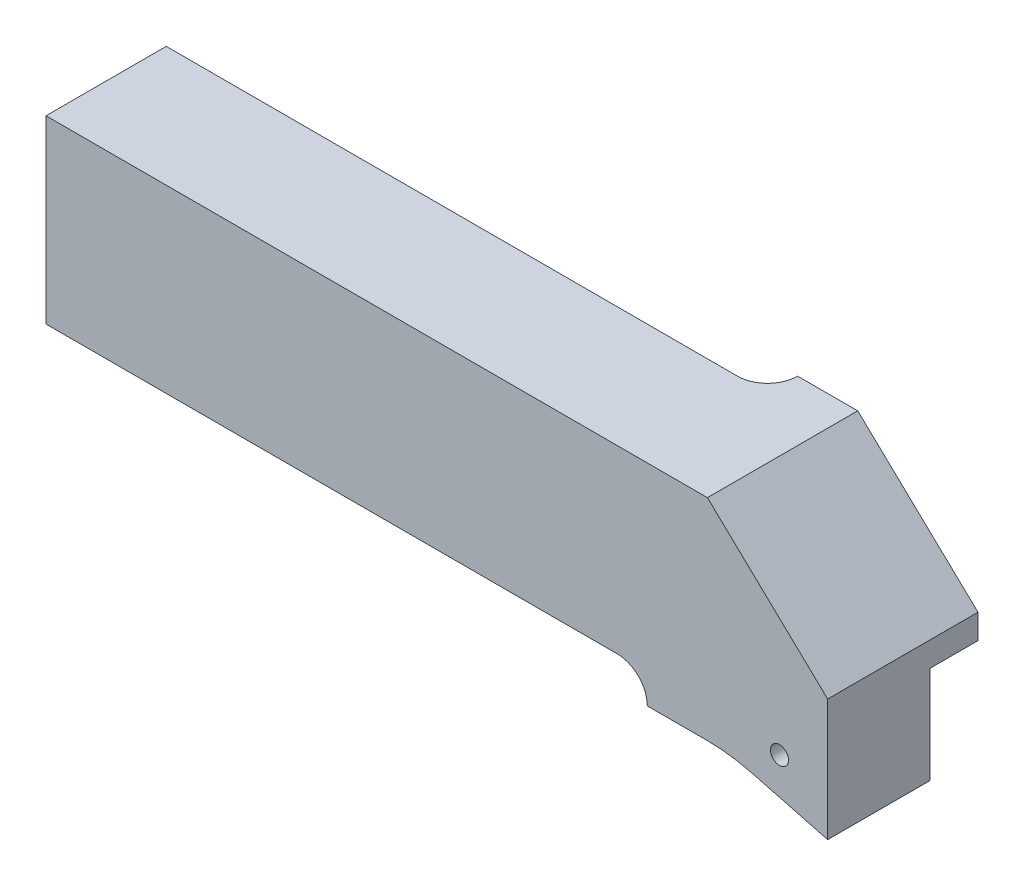
ISO-10303-21;
HEADER;
FILE_DESCRIPTION(('STEP AP214'),'2;1');
FILE_NAME('part.step','',(''),(''),'','','');
FILE_SCHEMA(('AUTOMOTIVE_DESIGN { 1 0 10303 214 1 1 1 1 }'));
ENDSEC;
DATA;
#1=APPLICATION_CONTEXT('core data for automotive mechanical design processes');
#2=APPLICATION_PROTOCOL_DEFINITION('international standard','automotive_design',2000,#1);
#3=PRODUCT_CONTEXT('',#1,'mechanical');
#4=PRODUCT('Part','Part','',(#3));
#5=PRODUCT_RELATED_PRODUCT_CATEGORY('part','',(#4));
#6=PRODUCT_DEFINITION_FORMATION('','',#4);
#7=PRODUCT_DEFINITION_CONTEXT('part definition',#1,'design');
#8=PRODUCT_DEFINITION('design','',#6,#7);
#9=PRODUCT_DEFINITION_SHAPE('','',#8);
#10=(LENGTH_UNIT() NAMED_UNIT(*) SI_UNIT(.MILLI.,.METRE.));
#11=(NAMED_UNIT(*) PLANE_ANGLE_UNIT() SI_UNIT($,.RADIAN.));
#12=(NAMED_UNIT(*) SI_UNIT($,.STERADIAN.) SOLID_ANGLE_UNIT());
#13=UNCERTAINTY_MEASURE_WITH_UNIT(LENGTH_MEASURE(1.E-05),#10,'distance_accuracy_value','');
#14=(GEOMETRIC_REPRESENTATION_CONTEXT(3) GLOBAL_UNCERTAINTY_ASSIGNED_CONTEXT((#13)) GLOBAL_UNIT_ASSIGNED_CONTEXT((#10,
#11,#12)) REPRESENTATION_CONTEXT('',''));
#15=CARTESIAN_POINT('',(0.,0.,0.));
#16=DIRECTION('',(0.,0.,1.));
#17=DIRECTION('',(1.,0.,0.));
#18=AXIS2_PLACEMENT_3D('',#15,#16,#17);
#19=CARTESIAN_POINT('',(77.4303974019249,-20.9751971017439,-5.));
#20=DIRECTION('',(-0.252896150661333,-0.967493429941868,0.));
#21=DIRECTION('',(0.967493429941868,-0.252896150661333,0.));
#22=AXIS2_PLACEMENT_3D('',#19,#20,#21);
#23=PLANE('',#22);
#24=DIRECTION('',(0.,0.,1.));
#25=VECTOR('',#24,1.);
#26=CARTESIAN_POINT('',(77.4303974019249,-20.9751971017439,-5.));
#27=LINE('',#26,#25);
#28=CARTESIAN_POINT('',(77.4303974019249,-20.975197101744,3.));
#29=VERTEX_POINT('',#28);
#30=CARTESIAN_POINT('',(77.4303974019249,-20.9751971017439,20.));
#31=VERTEX_POINT('',#30);
#32=EDGE_CURVE('E151',#29,#31,#27,.T.);
#33=ORIENTED_EDGE('',*,*,#32,.F.);
#34=DIRECTION('',(-0.967493429941868,0.252896150661333,0.));
#35=VECTOR('',#34,1.);
#36=CARTESIAN_POINT('',(77.4303974019249,-20.9751971017439,3.));
#37=LINE('',#36,#35);
#38=CARTESIAN_POINT('',(90.,-24.2608050593989,3.));
#39=VERTEX_POINT('',#38);
#40=EDGE_CURVE('E136',#39,#29,#37,.T.);
#41=ORIENTED_EDGE('',*,*,#40,.F.);
#42=DIRECTION('',(0.,0.,1.));
#43=VECTOR('',#42,1.);
#44=CARTESIAN_POINT('',(90.,-24.2608050593989,-5.));
#45=LINE('',#44,#43);
#46=CARTESIAN_POINT('',(90.,-24.2608050593989,20.));
#47=VERTEX_POINT('',#46);
#48=EDGE_CURVE('E149',#39,#47,#45,.T.);
#49=ORIENTED_EDGE('',*,*,#48,.T.);
#50=DIRECTION('',(0.967493429941868,-0.252896150661333,0.));
#51=VECTOR('',#50,1.);
#52=CARTESIAN_POINT('',(77.4303974019249,-20.9751971017439,20.));
#53=LINE('',#52,#51);
#54=EDGE_CURVE('E245',#31,#47,#53,.T.);
#55=ORIENTED_EDGE('',*,*,#54,.F.);
#56=EDGE_LOOP('',(#33,#41,#49,#55));
#57=FACE_BOUND('',#56,.T.);
#58=ADVANCED_FACE('F36',(#57),#23,.T.);
#59=CARTESIAN_POINT('',(-40.,15.,20.));
#60=DIRECTION('',(0.,-1.,0.));
#61=DIRECTION('',(0.,0.,-1.));
#62=AXIS2_PLACEMENT_3D('',#59,#60,#61);
#63=PLANE('',#62);
#64=DIRECTION('',(-1.,0.,0.));
#65=VECTOR('',#64,1.);
#66=CARTESIAN_POINT('',(60.,15.,-5.));
#67=LINE('',#66,#65);
#68=CARTESIAN_POINT('',(70.,15.,-5.));
#69=VERTEX_POINT('',#68);
#70=CARTESIAN_POINT('',(60.,15.,-5.));
#71=VERTEX_POINT('',#70);
#72=EDGE_CURVE('E170',#69,#71,#67,.T.);
#73=ORIENTED_EDGE('',*,*,#72,.T.);
#74=CARTESIAN_POINT('',(55.,15.,-5.));
#75=DIRECTION('',(0.,-1.,0.));
#76=DIRECTION('',(0.,0.,-1.));
#77=AXIS2_PLACEMENT_3D('',#74,#75,#76);
#78=CIRCLE('',#77,5.);
#79=CARTESIAN_POINT('',(55.,15.,0.));
#80=VERTEX_POINT('',#79);
#81=EDGE_CURVE('E11',#71,#80,#78,.T.);
#82=ORIENTED_EDGE('',*,*,#81,.T.);
#83=DIRECTION('',(-1.,0.,0.));
#84=VECTOR('',#83,1.);
#85=CARTESIAN_POINT('',(-40.,15.,0.));
#86=LINE('',#85,#84);
#87=CARTESIAN_POINT('',(-40.,15.,0.));
#88=VERTEX_POINT('',#87);
#89=EDGE_CURVE('E179',#80,#88,#86,.T.);
#90=ORIENTED_EDGE('',*,*,#89,.T.);
#91=DIRECTION('',(0.,0.,-1.));
#92=VECTOR('',#91,1.);
#93=CARTESIAN_POINT('',(-40.,15.,20.));
#94=LINE('',#93,#92);
#95=CARTESIAN_POINT('',(-40.,15.,20.));
#96=VERTEX_POINT('',#95);
#97=EDGE_CURVE('E185',#96,#88,#94,.T.);
#98=ORIENTED_EDGE('',*,*,#97,.F.);
#99=DIRECTION('',(-1.,0.,0.));
#100=VECTOR('',#99,1.);
#101=CARTESIAN_POINT('',(-40.,15.,20.));
#102=LINE('',#101,#100);
#103=CARTESIAN_POINT('',(70.,15.,20.));
#104=VERTEX_POINT('',#103);
#105=EDGE_CURVE('E171',#104,#96,#102,.T.);
#106=ORIENTED_EDGE('',*,*,#105,.F.);
#107=DIRECTION('',(0.,0.,1.));
#108=VECTOR('',#107,1.);
#109=CARTESIAN_POINT('',(70.,15.,-5.));
#110=LINE('',#109,#108);
#111=EDGE_CURVE('E160',#69,#104,#110,.T.);
#112=ORIENTED_EDGE('',*,*,#111,.F.);
#113=EDGE_LOOP('',(#73,#82,#90,#98,#106,#112));
#114=FACE_BOUND('',#113,.T.);
#115=ADVANCED_FACE('F273',(#114),#63,.F.);
#116=CARTESIAN_POINT('',(-40.,15.,20.));
#117=DIRECTION('',(1.,0.,0.));
#118=DIRECTION('',(0.,0.,-1.));
#119=AXIS2_PLACEMENT_3D('',#116,#117,#118);
#120=PLANE('',#119);
#121=DIRECTION('',(0.,-1.,0.));
#122=VECTOR('',#121,1.);
#123=CARTESIAN_POINT('',(-40.,15.,0.));
#124=LINE('',#123,#122);
#125=CARTESIAN_POINT('',(-40.,-15.,0.));
#126=VERTEX_POINT('',#125);
#127=EDGE_CURVE('E177',#88,#126,#124,.T.);
#128=ORIENTED_EDGE('',*,*,#127,.T.);
#129=DIRECTION('',(0.,0.,-1.));
#130=VECTOR('',#129,1.);
#131=CARTESIAN_POINT('',(-40.,-15.,20.));
#132=LINE('',#131,#130);
#133=CARTESIAN_POINT('',(-40.,-15.,20.));
#134=VERTEX_POINT('',#133);
#135=EDGE_CURVE('E182',#134,#126,#132,.T.);
#136=ORIENTED_EDGE('',*,*,#135,.F.);
#137=DIRECTION('',(0.,-1.,0.));
#138=VECTOR('',#137,1.);
#139=CARTESIAN_POINT('',(-40.,15.,20.));
#140=LINE('',#139,#138);
#141=EDGE_CURVE('E173',#96,#134,#140,.T.);
#142=ORIENTED_EDGE('',*,*,#141,.F.);
#143=ORIENTED_EDGE('',*,*,#97,.T.);
#144=EDGE_LOOP('',(#128,#136,#142,#143));
#145=FACE_BOUND('',#144,.T.);
#146=ADVANCED_FACE('F275',(#145),#120,.F.);
#147=CARTESIAN_POINT('',(-40.,-15.,20.));
#148=DIRECTION('',(0.,1.,0.));
#149=DIRECTION('',(0.,0.,1.));
#150=AXIS2_PLACEMENT_3D('',#147,#148,#149);
#151=PLANE('',#150);
#152=DIRECTION('',(1.,0.,0.));
#153=VECTOR('',#152,1.);
#154=CARTESIAN_POINT('',(-40.,-15.,0.));
#155=LINE('',#154,#153);
#156=CARTESIAN_POINT('',(55.,-15.,0.));
#157=VERTEX_POINT('',#156);
#158=EDGE_CURVE('E174',#126,#157,#155,.T.);
#159=ORIENTED_EDGE('',*,*,#158,.T.);
#160=DIRECTION('',(0.,0.,-1.));
#161=VECTOR('',#160,1.);
#162=CARTESIAN_POINT('',(55.,-15.,20.));
#163=LINE('',#162,#161);
#164=CARTESIAN_POINT('',(55.,-15.,20.));
#165=VERTEX_POINT('',#164);
#166=EDGE_CURVE('E188',#157,#165,#163,.F.);
#167=ORIENTED_EDGE('',*,*,#166,.T.);
#168=DIRECTION('',(1.,0.,0.));
#169=VECTOR('',#168,1.);
#170=CARTESIAN_POINT('',(-40.,-15.,20.));
#171=LINE('',#170,#169);
#172=EDGE_CURVE('E176',#134,#165,#171,.T.);
#173=ORIENTED_EDGE('',*,*,#172,.F.);
#174=ORIENTED_EDGE('',*,*,#135,.T.);
#175=EDGE_LOOP('',(#159,#167,#173,#174));
#176=FACE_BOUND('',#175,.T.);
#177=ADVANCED_FACE('F281',(#176),#151,.F.);
#178=CARTESIAN_POINT('',(0.,0.,20.));
#179=DIRECTION('',(0.,0.,1.));
#180=DIRECTION('',(1.,0.,0.));
#181=AXIS2_PLACEMENT_3D('',#178,#179,#180);
#182=PLANE('',#181);
#183=CARTESIAN_POINT('',(81.993244167461,-16.076814440537,20.));
#184=DIRECTION('',(0.,0.,-1.));
#185=DIRECTION('',(-1.,0.,0.));
#186=AXIS2_PLACEMENT_3D('',#183,#184,#185);
#187=CIRCLE('',#186,1.5);
#188=CARTESIAN_POINT('',(80.493244167461,-16.076814440537,20.));
#189=VERTEX_POINT('',#188);
#190=EDGE_CURVE('E264',#189,#189,#187,.T.);
#191=ORIENTED_EDGE('',*,*,#190,.T.);
#192=EDGE_LOOP('',(#191));
#193=FACE_BOUND('',#192,.T.);
#194=ORIENTED_EDGE('',*,*,#172,.T.);
#195=CARTESIAN_POINT('',(55.,-20.,20.));
#196=DIRECTION('',(0.,0.,1.));
#197=DIRECTION('',(1.,0.,0.));
#198=AXIS2_PLACEMENT_3D('',#195,#196,#197);
#199=CIRCLE('',#198,5.);
#200=CARTESIAN_POINT('',(60.,-20.,20.));
#201=VERTEX_POINT('',#200);
#202=EDGE_CURVE('E45',#165,#201,#199,.F.);
#203=ORIENTED_EDGE('',*,*,#202,.T.);
#204=DIRECTION('',(1.,0.,0.));
#205=VECTOR('',#204,1.);
#206=CARTESIAN_POINT('',(60.,-20.,20.));
#207=LINE('',#206,#205);
#208=CARTESIAN_POINT('',(69.8435128820849,-20.,20.));
#209=VERTEX_POINT('',#208);
#210=EDGE_CURVE('E205',#201,#209,#207,.T.);
#211=ORIENTED_EDGE('',*,*,#210,.T.);
#212=CARTESIAN_POINT('',(69.8435128820849,-50.,20.));
#213=DIRECTION('',(0.,0.,-1.));
#214=DIRECTION('',(-1.,0.,0.));
#215=AXIS2_PLACEMENT_3D('',#212,#213,#214);
#216=CIRCLE('',#215,30.);
#217=EDGE_CURVE('E215',#209,#31,#216,.T.);
#218=ORIENTED_EDGE('',*,*,#217,.T.);
#219=ORIENTED_EDGE('',*,*,#54,.T.);
#220=DIRECTION('',(0.,1.,0.));
#221=VECTOR('',#220,1.);
#222=CARTESIAN_POINT('',(90.,-20.,20.));
#223=LINE('',#222,#221);
#224=CARTESIAN_POINT('',(89.9999999999999,-4.,20.));
#225=VERTEX_POINT('',#224);
#226=EDGE_CURVE('E156',#47,#225,#223,.T.);
#227=ORIENTED_EDGE('',*,*,#226,.T.);
#228=DIRECTION('',(-0.724999433594413,0.688749461914694,0.));
#229=VECTOR('',#228,1.);
#230=CARTESIAN_POINT('',(89.9999999999999,-4.,20.));
#231=LINE('',#230,#229);
#232=EDGE_CURVE('E227',#225,#104,#231,.T.);
#233=ORIENTED_EDGE('',*,*,#232,.T.);
#234=ORIENTED_EDGE('',*,*,#105,.T.);
#235=ORIENTED_EDGE('',*,*,#141,.T.);
#236=EDGE_LOOP('',(#194,#203,#211,#218,#219,#227,#233,#234,#235));
#237=FACE_BOUND('',#236,.T.);
#238=ADVANCED_FACE('F203',(#193,#237),#182,.T.);
#239=CARTESIAN_POINT('',(0.,0.,0.));
#240=DIRECTION('',(0.,0.,1.));
#241=DIRECTION('',(1.,0.,0.));
#242=AXIS2_PLACEMENT_3D('',#239,#240,#241);
#243=PLANE('',#242);
#244=ORIENTED_EDGE('',*,*,#89,.F.);
#245=DIRECTION('',(0.,1.,0.));
#246=VECTOR('',#245,1.);
#247=CARTESIAN_POINT('',(55.,0.,0.));
#248=LINE('',#247,#246);
#249=EDGE_CURVE('E197',#80,#157,#248,.F.);
#250=ORIENTED_EDGE('',*,*,#249,.T.);
#251=ORIENTED_EDGE('',*,*,#158,.F.);
#252=ORIENTED_EDGE('',*,*,#127,.F.);
#253=EDGE_LOOP('',(#244,#250,#251,#252));
#254=FACE_BOUND('',#253,.T.);
#255=ADVANCED_FACE('F304',(#254),#243,.F.);
#256=CARTESIAN_POINT('',(89.9999999999999,-4.,-5.));
#257=DIRECTION('',(0.688749461914694,0.724999433594413,0.));
#258=DIRECTION('',(-0.724999433594413,0.688749461914694,0.));
#259=AXIS2_PLACEMENT_3D('',#256,#257,#258);
#260=PLANE('',#259);
#261=ORIENTED_EDGE('',*,*,#232,.F.);
#262=DIRECTION('',(0.,0.,1.));
#263=VECTOR('',#262,1.);
#264=CARTESIAN_POINT('',(89.9999999999999,-4.,-5.));
#265=LINE('',#264,#263);
#266=CARTESIAN_POINT('',(89.9999999999999,-4.,-5.));
#267=VERTEX_POINT('',#266);
#268=EDGE_CURVE('E158',#267,#225,#265,.T.);
#269=ORIENTED_EDGE('',*,*,#268,.F.);
#270=DIRECTION('',(-0.724999433594413,0.688749461914694,0.));
#271=VECTOR('',#270,1.);
#272=CARTESIAN_POINT('',(89.9999999999999,-4.,-5.));
#273=LINE('',#272,#271);
#274=EDGE_CURVE('E240',#267,#69,#273,.T.);
#275=ORIENTED_EDGE('',*,*,#274,.T.);
#276=ORIENTED_EDGE('',*,*,#111,.T.);
#277=EDGE_LOOP('',(#261,#269,#275,#276));
#278=FACE_BOUND('',#277,.T.);
#279=ADVANCED_FACE('F250',(#278),#260,.T.);
#280=CARTESIAN_POINT('',(90.,-20.,-5.));
#281=DIRECTION('',(1.,0.,0.));
#282=DIRECTION('',(0.,1.,0.));
#283=AXIS2_PLACEMENT_3D('',#280,#281,#282);
#284=PLANE('',#283);
#285=DIRECTION('',(0.,0.,-1.));
#286=VECTOR('',#285,1.);
#287=CARTESIAN_POINT('',(90.,-8.09602732765623,3.));
#288=LINE('',#287,#286);
#289=CARTESIAN_POINT('',(90.,-8.09602732765623,3.));
#290=VERTEX_POINT('',#289);
#291=CARTESIAN_POINT('',(90.,-8.09602732765623,-5.));
#292=VERTEX_POINT('',#291);
#293=EDGE_CURVE('E222',#290,#292,#288,.T.);
#294=ORIENTED_EDGE('',*,*,#293,.T.);
#295=DIRECTION('',(0.,1.,0.));
#296=VECTOR('',#295,1.);
#297=CARTESIAN_POINT('',(90.,-24.2608050593989,-5.));
#298=LINE('',#297,#296);
#299=EDGE_CURVE('E238',#292,#267,#298,.T.);
#300=ORIENTED_EDGE('',*,*,#299,.T.);
#301=ORIENTED_EDGE('',*,*,#268,.T.);
#302=ORIENTED_EDGE('',*,*,#226,.F.);
#303=ORIENTED_EDGE('',*,*,#48,.F.);
#304=DIRECTION('',(0.,-1.,0.));
#305=VECTOR('',#304,1.);
#306=CARTESIAN_POINT('',(90.,-24.2608050593989,3.));
#307=LINE('',#306,#305);
#308=EDGE_CURVE('E132',#290,#39,#307,.T.);
#309=ORIENTED_EDGE('',*,*,#308,.F.);
#310=EDGE_LOOP('',(#294,#300,#301,#302,#303,#309));
#311=FACE_BOUND('',#310,.T.);
#312=ADVANCED_FACE('F154',(#311),#284,.T.);
#313=CARTESIAN_POINT('',(69.8435128820849,-50.,-5.));
#314=DIRECTION('',(0.,0.,1.));
#315=DIRECTION('',(1.,0.,0.));
#316=AXIS2_PLACEMENT_3D('',#313,#314,#315);
#317=CYLINDRICAL_SURFACE('',#316,30.);
#318=DIRECTION('',(0.,0.,-1.));
#319=VECTOR('',#318,1.);
#320=CARTESIAN_POINT('',(75.,-20.446478372235,3.));
#321=LINE('',#320,#319);
#322=CARTESIAN_POINT('',(75.,-20.446478372235,3.));
#323=VERTEX_POINT('',#322);
#324=CARTESIAN_POINT('',(75.,-20.446478372235,-5.));
#325=VERTEX_POINT('',#324);
#326=EDGE_CURVE('E52',#323,#325,#321,.T.);
#327=ORIENTED_EDGE('',*,*,#326,.F.);
#328=CARTESIAN_POINT('',(69.8435128820849,-50.,3.));
#329=DIRECTION('',(0.,0.,1.));
#330=DIRECTION('',(-1.,0.,0.));
#331=AXIS2_PLACEMENT_3D('',#328,#329,#330);
#332=CIRCLE('',#331,30.);
#333=EDGE_CURVE('E152',#29,#323,#332,.T.);
#334=ORIENTED_EDGE('',*,*,#333,.F.);
#335=ORIENTED_EDGE('',*,*,#32,.T.);
#336=ORIENTED_EDGE('',*,*,#217,.F.);
#337=DIRECTION('',(0.,0.,1.));
#338=VECTOR('',#337,1.);
#339=CARTESIAN_POINT('',(69.8435128820849,-20.,-5.));
#340=LINE('',#339,#338);
#341=CARTESIAN_POINT('',(69.8435128820849,-20.,-5.));
#342=VERTEX_POINT('',#341);
#343=EDGE_CURVE('E162',#342,#209,#340,.T.);
#344=ORIENTED_EDGE('',*,*,#343,.F.);
#345=CARTESIAN_POINT('',(69.8435128820849,-50.,-5.));
#346=DIRECTION('',(0.,0.,-1.));
#347=DIRECTION('',(-1.,0.,0.));
#348=AXIS2_PLACEMENT_3D('',#345,#346,#347);
#349=CIRCLE('',#348,30.);
#350=EDGE_CURVE('E229',#342,#325,#349,.T.);
#351=ORIENTED_EDGE('',*,*,#350,.T.);
#352=EDGE_LOOP('',(#327,#334,#335,#336,#344,#351));
#353=FACE_BOUND('',#352,.T.);
#354=ADVANCED_FACE('F255',(#353),#317,.F.);
#355=CARTESIAN_POINT('',(60.,-20.,-5.));
#356=DIRECTION('',(0.,-1.,0.));
#357=DIRECTION('',(0.,0.,-1.));
#358=AXIS2_PLACEMENT_3D('',#355,#356,#357);
#359=PLANE('',#358);
#360=ORIENTED_EDGE('',*,*,#210,.F.);
#361=DIRECTION('',(0.,0.,1.));
#362=VECTOR('',#361,1.);
#363=CARTESIAN_POINT('',(60.,-20.,-5.));
#364=LINE('',#363,#362);
#365=CARTESIAN_POINT('',(60.,-20.,-5.));
#366=VERTEX_POINT('',#365);
#367=EDGE_CURVE('E167',#366,#201,#364,.T.);
#368=ORIENTED_EDGE('',*,*,#367,.F.);
#369=DIRECTION('',(1.,0.,0.));
#370=VECTOR('',#369,1.);
#371=CARTESIAN_POINT('',(60.,-20.,-5.));
#372=LINE('',#371,#370);
#373=EDGE_CURVE('E226',#366,#342,#372,.T.);
#374=ORIENTED_EDGE('',*,*,#373,.T.);
#375=ORIENTED_EDGE('',*,*,#343,.T.);
#376=EDGE_LOOP('',(#360,#368,#374,#375));
#377=FACE_BOUND('',#376,.T.);
#378=ADVANCED_FACE('F211',(#377),#359,.T.);
#379=CARTESIAN_POINT('',(69.8435128820849,-50.,-5.));
#380=DIRECTION('',(0.,0.,-1.));
#381=DIRECTION('',(-1.,0.,0.));
#382=AXIS2_PLACEMENT_3D('',#379,#380,#381);
#383=PLANE('',#382);
#384=DIRECTION('',(0.99846252913224,0.0554308390595991,0.));
#385=VECTOR('',#384,1.);
#386=CARTESIAN_POINT('',(90.,-8.09602732765623,-5.));
#387=LINE('',#386,#385);
#388=CARTESIAN_POINT('',(75.,-8.92877023150522,-5.));
#389=VERTEX_POINT('',#388);
#390=EDGE_CURVE('E144',#389,#292,#387,.T.);
#391=ORIENTED_EDGE('',*,*,#390,.F.);
#392=DIRECTION('',(0.,1.,0.));
#393=VECTOR('',#392,1.);
#394=CARTESIAN_POINT('',(75.,-8.92877023150522,-5.));
#395=LINE('',#394,#393);
#396=EDGE_CURVE('E262',#325,#389,#395,.T.);
#397=ORIENTED_EDGE('',*,*,#396,.F.);
#398=ORIENTED_EDGE('',*,*,#350,.F.);
#399=ORIENTED_EDGE('',*,*,#373,.F.);
#400=DIRECTION('',(0.,-1.,0.));
#401=VECTOR('',#400,1.);
#402=CARTESIAN_POINT('',(60.,15.,-5.));
#403=LINE('',#402,#401);
#404=EDGE_CURVE('E223',#71,#366,#403,.T.);
#405=ORIENTED_EDGE('',*,*,#404,.F.);
#406=ORIENTED_EDGE('',*,*,#72,.F.);
#407=ORIENTED_EDGE('',*,*,#274,.F.);
#408=ORIENTED_EDGE('',*,*,#299,.F.);
#409=EDGE_LOOP('',(#391,#397,#398,#399,#405,#406,#407,#408));
#410=FACE_BOUND('',#409,.T.);
#411=ADVANCED_FACE('F272',(#410),#383,.T.);
#412=CARTESIAN_POINT('',(55.,15.,-5.));
#413=DIRECTION('',(0.,1.,0.));
#414=DIRECTION('',(-1.,0.,0.));
#415=AXIS2_PLACEMENT_3D('',#412,#413,#414);
#416=CYLINDRICAL_SURFACE('',#415,5.);
#417=ORIENTED_EDGE('',*,*,#81,.F.);
#418=ORIENTED_EDGE('',*,*,#404,.T.);
#419=CARTESIAN_POINT('',(55.,-20.,-5.));
#420=DIRECTION('',(0.,0.707106781186547,-0.707106781186547));
#421=DIRECTION('',(0.,0.707106781186547,0.707106781186547));
#422=AXIS2_PLACEMENT_3D('',#419,#420,#421);
#423=ELLIPSE('',#422,7.07106781186547,5.);
#424=EDGE_CURVE('E40',#157,#366,#423,.T.);
#425=ORIENTED_EDGE('',*,*,#424,.F.);
#426=ORIENTED_EDGE('',*,*,#249,.F.);
#427=EDGE_LOOP('',(#417,#418,#425,#426));
#428=FACE_BOUND('',#427,.T.);
#429=ADVANCED_FACE('F38',(#428),#416,.F.);
#430=CARTESIAN_POINT('',(55.,-20.,-5.));
#431=DIRECTION('',(0.,0.,-1.));
#432=DIRECTION('',(-1.,0.,0.));
#433=AXIS2_PLACEMENT_3D('',#430,#431,#432);
#434=CYLINDRICAL_SURFACE('',#433,5.);
#435=ORIENTED_EDGE('',*,*,#202,.F.);
#436=ORIENTED_EDGE('',*,*,#166,.F.);
#437=ORIENTED_EDGE('',*,*,#424,.T.);
#438=ORIENTED_EDGE('',*,*,#367,.T.);
#439=EDGE_LOOP('',(#435,#436,#437,#438));
#440=FACE_BOUND('',#439,.T.);
#441=ADVANCED_FACE('F217',(#440),#434,.F.);
#442=CARTESIAN_POINT('',(90.,-8.09602732765623,3.));
#443=DIRECTION('',(-0.0554308390595991,0.99846252913224,0.));
#444=DIRECTION('',(-0.99846252913224,-0.0554308390595991,0.));
#445=AXIS2_PLACEMENT_3D('',#442,#443,#444);
#446=PLANE('',#445);
#447=ORIENTED_EDGE('',*,*,#390,.T.);
#448=ORIENTED_EDGE('',*,*,#293,.F.);
#449=DIRECTION('',(0.99846252913224,0.0554308390595991,0.));
#450=VECTOR('',#449,1.);
#451=CARTESIAN_POINT('',(90.,-8.09602732765623,3.));
#452=LINE('',#451,#450);
#453=CARTESIAN_POINT('',(75.,-8.92877023150522,3.));
#454=VERTEX_POINT('',#453);
#455=EDGE_CURVE('E140',#454,#290,#452,.T.);
#456=ORIENTED_EDGE('',*,*,#455,.F.);
#457=DIRECTION('',(0.,0.,-1.));
#458=VECTOR('',#457,1.);
#459=CARTESIAN_POINT('',(75.,-8.92877023150522,3.));
#460=LINE('',#459,#458);
#461=EDGE_CURVE('E266',#454,#389,#460,.T.);
#462=ORIENTED_EDGE('',*,*,#461,.T.);
#463=EDGE_LOOP('',(#447,#448,#456,#462));
#464=FACE_BOUND('',#463,.T.);
#465=ADVANCED_FACE('F268',(#464),#446,.F.);
#466=CARTESIAN_POINT('',(75.,-8.92877023150522,3.));
#467=DIRECTION('',(-1.,0.,0.));
#468=DIRECTION('',(0.,0.,1.));
#469=AXIS2_PLACEMENT_3D('',#466,#467,#468);
#470=PLANE('',#469);
#471=ORIENTED_EDGE('',*,*,#396,.T.);
#472=ORIENTED_EDGE('',*,*,#461,.F.);
#473=DIRECTION('',(0.,1.,0.));
#474=VECTOR('',#473,1.);
#475=CARTESIAN_POINT('',(75.,-8.92877023150522,3.));
#476=LINE('',#475,#474);
#477=EDGE_CURVE('E257',#323,#454,#476,.T.);
#478=ORIENTED_EDGE('',*,*,#477,.F.);
#479=ORIENTED_EDGE('',*,*,#326,.T.);
#480=EDGE_LOOP('',(#471,#472,#478,#479));
#481=FACE_BOUND('',#480,.T.);
#482=ADVANCED_FACE('F270',(#481),#470,.F.);
#483=CARTESIAN_POINT('',(69.8435128820849,-50.,3.));
#484=DIRECTION('',(0.,0.,-1.));
#485=DIRECTION('',(-1.,0.,0.));
#486=AXIS2_PLACEMENT_3D('',#483,#484,#485);
#487=PLANE('',#486);
#488=CARTESIAN_POINT('',(81.993244167461,-16.076814440537,3.));
#489=DIRECTION('',(0.,0.,-1.));
#490=DIRECTION('',(-1.,0.,0.));
#491=AXIS2_PLACEMENT_3D('',#488,#489,#490);
#492=CIRCLE('',#491,1.5);
#493=CARTESIAN_POINT('',(80.493244167461,-16.076814440537,3.));
#494=VERTEX_POINT('',#493);
#495=EDGE_CURVE('E406',#494,#494,#492,.T.);
#496=ORIENTED_EDGE('',*,*,#495,.F.);
#497=EDGE_LOOP('',(#496));
#498=FACE_BOUND('',#497,.T.);
#499=ORIENTED_EDGE('',*,*,#308,.T.);
#500=ORIENTED_EDGE('',*,*,#40,.T.);
#501=ORIENTED_EDGE('',*,*,#333,.T.);
#502=ORIENTED_EDGE('',*,*,#477,.T.);
#503=ORIENTED_EDGE('',*,*,#455,.T.);
#504=EDGE_LOOP('',(#499,#500,#501,#502,#503));
#505=FACE_BOUND('',#504,.T.);
#506=ADVANCED_FACE('F134',(#498,#505),#487,.T.);
#507=CARTESIAN_POINT('',(81.993244167461,-16.076814440537,20.));
#508=DIRECTION('',(0.,0.,-1.));
#509=DIRECTION('',(-1.,0.,0.));
#510=AXIS2_PLACEMENT_3D('',#507,#508,#509);
#511=CYLINDRICAL_SURFACE('',#510,1.5);
#512=ORIENTED_EDGE('',*,*,#190,.F.);
#513=EDGE_LOOP('',(#512));
#514=FACE_BOUND('',#513,.T.);
#515=ORIENTED_EDGE('',*,*,#495,.T.);
#516=EDGE_LOOP('',(#515));
#517=FACE_BOUND('',#516,.T.);
#518=ADVANCED_FACE('F384',(#514,#517),#511,.F.);
#519=CLOSED_SHELL('',(#58,#115,#146,#177,#238,#255,#279,#312,#354,#378,#411,#429,#441,#465,#482,
#506,#518));
#520=MANIFOLD_SOLID_BREP('B2',#519);
#521=ADVANCED_BREP_SHAPE_REPRESENTATION('',(#18,#520),#14);
#522=SHAPE_DEFINITION_REPRESENTATION(#9,#521);
ENDSEC;
END-ISO-10303-21;
